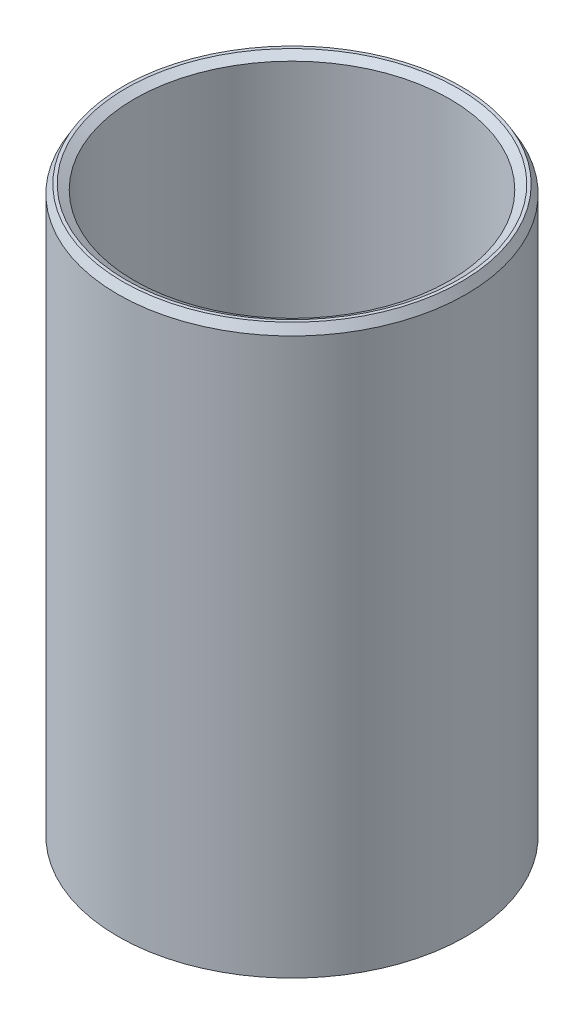
ISO-10303-21;
HEADER;
FILE_DESCRIPTION(('STEP AP214'),'2;1');
FILE_NAME('part.step','',(''),(''),'','','');
FILE_SCHEMA(('AUTOMOTIVE_DESIGN { 1 0 10303 214 1 1 1 1 }'));
ENDSEC;
DATA;
#1=APPLICATION_CONTEXT('core data for automotive mechanical design processes');
#2=APPLICATION_PROTOCOL_DEFINITION('international standard','automotive_design',2000,#1);
#3=PRODUCT_CONTEXT('',#1,'mechanical');
#4=PRODUCT('Part','Part','',(#3));
#5=PRODUCT_RELATED_PRODUCT_CATEGORY('part','',(#4));
#6=PRODUCT_DEFINITION_FORMATION('','',#4);
#7=PRODUCT_DEFINITION_CONTEXT('part definition',#1,'design');
#8=PRODUCT_DEFINITION('design','',#6,#7);
#9=PRODUCT_DEFINITION_SHAPE('','',#8);
#10=(LENGTH_UNIT() NAMED_UNIT(*) SI_UNIT(.MILLI.,.METRE.));
#11=(NAMED_UNIT(*) PLANE_ANGLE_UNIT() SI_UNIT($,.RADIAN.));
#12=(NAMED_UNIT(*) SI_UNIT($,.STERADIAN.) SOLID_ANGLE_UNIT());
#13=UNCERTAINTY_MEASURE_WITH_UNIT(LENGTH_MEASURE(1.E-05),#10,'distance_accuracy_value','');
#14=(GEOMETRIC_REPRESENTATION_CONTEXT(3) GLOBAL_UNCERTAINTY_ASSIGNED_CONTEXT((#13)) GLOBAL_UNIT_ASSIGNED_CONTEXT((#10,
#11,#12)) REPRESENTATION_CONTEXT('',''));
#15=CARTESIAN_POINT('',(0.,0.,0.));
#16=DIRECTION('',(0.,0.,1.));
#17=DIRECTION('',(1.,0.,0.));
#18=AXIS2_PLACEMENT_3D('',#15,#16,#17);
#19=CARTESIAN_POINT('',(0.,171.761595614429,0.));
#20=DIRECTION('',(0.,-1.,0.));
#21=DIRECTION('',(0.,0.,-1.));
#22=AXIS2_PLACEMENT_3D('',#19,#20,#21);
#23=CYLINDRICAL_SURFACE('',#22,52.5);
#24=CARTESIAN_POINT('',(0.,1.47979281459718,0.));
#25=DIRECTION('',(0.,1.,0.));
#26=DIRECTION('',(0.,0.,1.));
#27=AXIS2_PLACEMENT_3D('',#24,#25,#26);
#28=CIRCLE('',#27,52.5);
#29=CARTESIAN_POINT('',(0.,1.47979281459718,52.5));
#30=VERTEX_POINT('',#29);
#31=EDGE_CURVE('E10',#30,#30,#28,.T.);
#32=ORIENTED_EDGE('',*,*,#31,.T.);
#33=EDGE_LOOP('',(#32));
#34=FACE_BOUND('',#33,.T.);
#35=CARTESIAN_POINT('',(0.,169.198519274871,0.));
#36=DIRECTION('',(0.,1.,0.));
#37=DIRECTION('',(0.,0.,1.));
#38=AXIS2_PLACEMENT_3D('',#35,#36,#37);
#39=CIRCLE('',#38,52.5);
#40=CARTESIAN_POINT('',(0.,169.198519274871,52.5));
#41=VERTEX_POINT('',#40);
#42=EDGE_CURVE('E50',#41,#41,#39,.F.);
#43=ORIENTED_EDGE('',*,*,#42,.T.);
#44=EDGE_LOOP('',(#43));
#45=FACE_BOUND('',#44,.T.);
#46=ADVANCED_FACE('F39',(#34,#45),#23,.T.);
#47=CARTESIAN_POINT('',(0.,171.761595614429,0.));
#48=DIRECTION('',(0.,1.,0.));
#49=DIRECTION('',(0.,0.,1.));
#50=AXIS2_PLACEMENT_3D('',#47,#48,#49);
#51=PLANE('',#50);
#52=CARTESIAN_POINT('',(0.,171.761595614429,0.));
#53=DIRECTION('',(0.,1.,0.));
#54=DIRECTION('',(0.,0.,1.));
#55=AXIS2_PLACEMENT_3D('',#52,#53,#54);
#56=CIRCLE('',#55,50.0817585577222);
#57=CARTESIAN_POINT('',(0.,171.761595614429,50.0817585577222));
#58=VERTEX_POINT('',#57);
#59=EDGE_CURVE('E58',#58,#58,#56,.F.);
#60=ORIENTED_EDGE('',*,*,#59,.T.);
#61=EDGE_LOOP('',(#60));
#62=FACE_BOUND('',#61,.T.);
#63=CARTESIAN_POINT('',(0.,171.761595614429,0.));
#64=DIRECTION('',(0.,1.,0.));
#65=DIRECTION('',(0.,0.,1.));
#66=AXIS2_PLACEMENT_3D('',#63,#64,#65);
#67=CIRCLE('',#66,51.0202071854029);
#68=CARTESIAN_POINT('',(0.,171.761595614429,51.0202071854029));
#69=VERTEX_POINT('',#68);
#70=EDGE_CURVE('E61',#69,#69,#67,.T.);
#71=ORIENTED_EDGE('',*,*,#70,.T.);
#72=EDGE_LOOP('',(#71));
#73=FACE_BOUND('',#72,.T.);
#74=ADVANCED_FACE('F88',(#62,#73),#51,.T.);
#75=CARTESIAN_POINT('',(0.,0.,0.));
#76=DIRECTION('',(0.,1.,0.));
#77=DIRECTION('',(0.,0.,1.));
#78=AXIS2_PLACEMENT_3D('',#75,#76,#77);
#79=PLANE('',#78);
#80=CARTESIAN_POINT('',(0.,0.,0.));
#81=DIRECTION('',(0.,1.,0.));
#82=DIRECTION('',(0.,0.,1.));
#83=AXIS2_PLACEMENT_3D('',#80,#81,#82);
#84=CIRCLE('',#83,48.9984750327617);
#85=CARTESIAN_POINT('',(0.,0.,48.9984750327617));
#86=VERTEX_POINT('',#85);
#87=EDGE_CURVE('E51',#86,#86,#84,.T.);
#88=ORIENTED_EDGE('',*,*,#87,.T.);
#89=EDGE_LOOP('',(#88));
#90=FACE_BOUND('',#89,.T.);
#91=CARTESIAN_POINT('',(0.,0.,0.));
#92=DIRECTION('',(0.,1.,0.));
#93=DIRECTION('',(0.,0.,1.));
#94=AXIS2_PLACEMENT_3D('',#91,#92,#93);
#95=CIRCLE('',#94,49.9369236604423);
#96=CARTESIAN_POINT('',(0.,0.,49.9369236604423));
#97=VERTEX_POINT('',#96);
#98=EDGE_CURVE('E54',#97,#97,#95,.F.);
#99=ORIENTED_EDGE('',*,*,#98,.T.);
#100=EDGE_LOOP('',(#99));
#101=FACE_BOUND('',#100,.T.);
#102=ADVANCED_FACE('F83',(#90,#101),#79,.F.);
#103=CARTESIAN_POINT('',(0.,171.761595614429,0.));
#104=DIRECTION('',(0.,-1.,0.));
#105=DIRECTION('',(0.,0.,-1.));
#106=AXIS2_PLACEMENT_3D('',#103,#104,#105);
#107=CYLINDRICAL_SURFACE('',#106,47.5186822181646);
#108=CARTESIAN_POINT('',(0.,170.281802799832,0.));
#109=DIRECTION('',(0.,1.,0.));
#110=DIRECTION('',(0.,0.,1.));
#111=AXIS2_PLACEMENT_3D('',#108,#109,#110);
#112=CIRCLE('',#111,47.5186822181646);
#113=CARTESIAN_POINT('',(0.,170.281802799832,47.5186822181646));
#114=VERTEX_POINT('',#113);
#115=EDGE_CURVE('E67',#114,#114,#112,.T.);
#116=ORIENTED_EDGE('',*,*,#115,.T.);
#117=EDGE_LOOP('',(#116));
#118=FACE_BOUND('',#117,.T.);
#119=CARTESIAN_POINT('',(0.,2.56307633955763,0.));
#120=DIRECTION('',(0.,1.,0.));
#121=DIRECTION('',(0.,0.,1.));
#122=AXIS2_PLACEMENT_3D('',#119,#120,#121);
#123=CIRCLE('',#122,47.5186822181646);
#124=CARTESIAN_POINT('',(0.,2.56307633955763,47.5186822181646));
#125=VERTEX_POINT('',#124);
#126=EDGE_CURVE('E69',#125,#125,#123,.F.);
#127=ORIENTED_EDGE('',*,*,#126,.T.);
#128=EDGE_LOOP('',(#127));
#129=FACE_BOUND('',#128,.T.);
#130=ADVANCED_FACE('F71',(#118,#129),#107,.F.);
#131=CARTESIAN_POINT('',(0.,170.281802799832,0.));
#132=DIRECTION('',(0.,1.,0.));
#133=DIRECTION('',(0.,0.,1.));
#134=AXIS2_PLACEMENT_3D('',#131,#132,#133);
#135=CONICAL_SURFACE('',#134,47.5186822181646,1.0471975511966);
#136=ORIENTED_EDGE('',*,*,#59,.F.);
#137=EDGE_LOOP('',(#136));
#138=FACE_BOUND('',#137,.T.);
#139=ORIENTED_EDGE('',*,*,#115,.F.);
#140=EDGE_LOOP('',(#139));
#141=FACE_BOUND('',#140,.T.);
#142=ADVANCED_FACE('F77',(#138,#141),#135,.F.);
#143=CARTESIAN_POINT('',(0.,0.,0.));
#144=DIRECTION('',(0.,-1.,0.));
#145=DIRECTION('',(0.,0.,-1.));
#146=AXIS2_PLACEMENT_3D('',#143,#144,#145);
#147=CONICAL_SURFACE('',#146,48.9984750327617,0.523598775598298);
#148=ORIENTED_EDGE('',*,*,#126,.F.);
#149=EDGE_LOOP('',(#148));
#150=FACE_BOUND('',#149,.T.);
#151=ORIENTED_EDGE('',*,*,#87,.F.);
#152=EDGE_LOOP('',(#151));
#153=FACE_BOUND('',#152,.T.);
#154=ADVANCED_FACE('F73',(#150,#153),#147,.F.);
#155=CARTESIAN_POINT('',(0.,1.47979281459718,0.));
#156=DIRECTION('',(0.,1.,0.));
#157=DIRECTION('',(0.,0.,1.));
#158=AXIS2_PLACEMENT_3D('',#155,#156,#157);
#159=CONICAL_SURFACE('',#158,52.5,1.0471975511966);
#160=ORIENTED_EDGE('',*,*,#98,.F.);
#161=EDGE_LOOP('',(#160));
#162=FACE_BOUND('',#161,.T.);
#163=ORIENTED_EDGE('',*,*,#31,.F.);
#164=EDGE_LOOP('',(#163));
#165=FACE_BOUND('',#164,.T.);
#166=ADVANCED_FACE('F76',(#162,#165),#159,.T.);
#167=CARTESIAN_POINT('',(0.,171.761595614429,0.));
#168=DIRECTION('',(0.,-1.,0.));
#169=DIRECTION('',(0.,0.,-1.));
#170=AXIS2_PLACEMENT_3D('',#167,#168,#169);
#171=CONICAL_SURFACE('',#170,51.0202071854029,0.523598775598298);
#172=ORIENTED_EDGE('',*,*,#42,.F.);
#173=EDGE_LOOP('',(#172));
#174=FACE_BOUND('',#173,.T.);
#175=ORIENTED_EDGE('',*,*,#70,.F.);
#176=EDGE_LOOP('',(#175));
#177=FACE_BOUND('',#176,.T.);
#178=ADVANCED_FACE('F45',(#174,#177),#171,.T.);
#179=CLOSED_SHELL('',(#46,#74,#102,#130,#142,#154,#166,#178));
#180=MANIFOLD_SOLID_BREP('B2',#179);
#181=ADVANCED_BREP_SHAPE_REPRESENTATION('',(#18,#180),#14);
#182=SHAPE_DEFINITION_REPRESENTATION(#9,#181);
ENDSEC;
END-ISO-10303-21;
